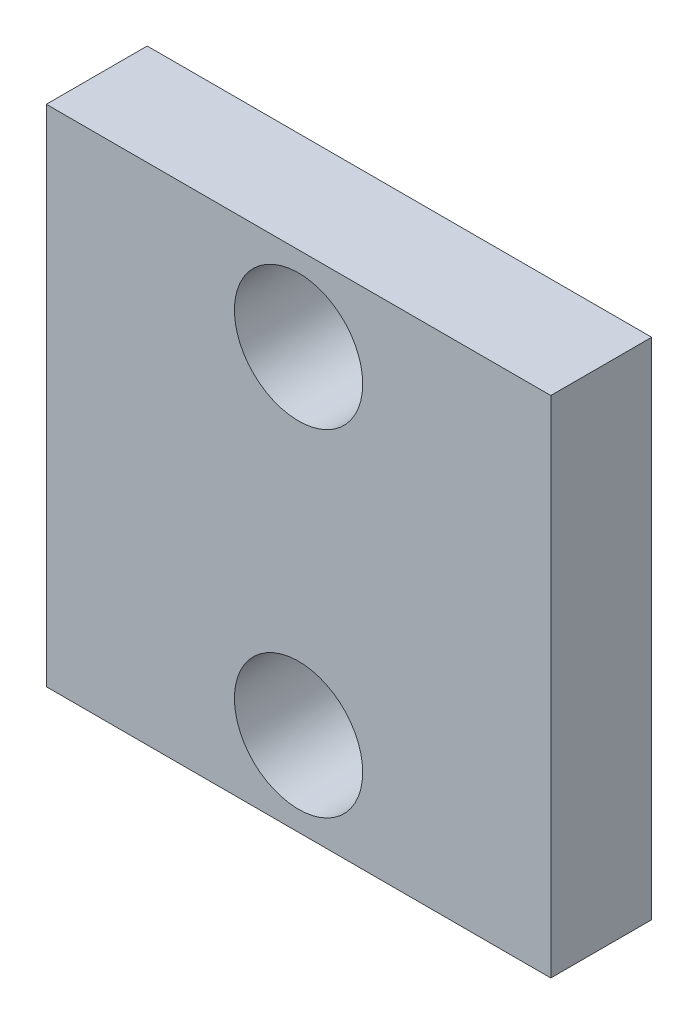
ISO-10303-21;
HEADER;
FILE_DESCRIPTION(('STEP AP214'),'2;1');
FILE_NAME('part.step','',(''),(''),'','','');
FILE_SCHEMA(('AUTOMOTIVE_DESIGN { 1 0 10303 214 1 1 1 1 }'));
ENDSEC;
DATA;
#1=APPLICATION_CONTEXT('core data for automotive mechanical design processes');
#2=APPLICATION_PROTOCOL_DEFINITION('international standard','automotive_design',2000,#1);
#3=PRODUCT_CONTEXT('',#1,'mechanical');
#4=PRODUCT('Part','Part','',(#3));
#5=PRODUCT_RELATED_PRODUCT_CATEGORY('part','',(#4));
#6=PRODUCT_DEFINITION_FORMATION('','',#4);
#7=PRODUCT_DEFINITION_CONTEXT('part definition',#1,'design');
#8=PRODUCT_DEFINITION('design','',#6,#7);
#9=PRODUCT_DEFINITION_SHAPE('','',#8);
#10=(LENGTH_UNIT() NAMED_UNIT(*) SI_UNIT(.MILLI.,.METRE.));
#11=(NAMED_UNIT(*) PLANE_ANGLE_UNIT() SI_UNIT($,.RADIAN.));
#12=(NAMED_UNIT(*) SI_UNIT($,.STERADIAN.) SOLID_ANGLE_UNIT());
#13=UNCERTAINTY_MEASURE_WITH_UNIT(LENGTH_MEASURE(1.E-05),#10,'distance_accuracy_value','');
#14=(GEOMETRIC_REPRESENTATION_CONTEXT(3) GLOBAL_UNCERTAINTY_ASSIGNED_CONTEXT((#13)) GLOBAL_UNIT_ASSIGNED_CONTEXT((#10,
#11,#12)) REPRESENTATION_CONTEXT('',''));
#15=CARTESIAN_POINT('',(0.,0.,0.));
#16=DIRECTION('',(0.,0.,1.));
#17=DIRECTION('',(1.,0.,0.));
#18=AXIS2_PLACEMENT_3D('',#15,#16,#17);
#19=CARTESIAN_POINT('',(0.,0.,12.));
#20=DIRECTION('',(0.,0.,-1.));
#21=DIRECTION('',(-1.,0.,0.));
#22=AXIS2_PLACEMENT_3D('',#19,#20,#21);
#23=PLANE('',#22);
#24=DIRECTION('',(0.,1.,0.));
#25=VECTOR('',#24,1.);
#26=CARTESIAN_POINT('',(30.,-30.,12.));
#27=LINE('',#26,#25);
#28=CARTESIAN_POINT('',(30.,-30.,12.));
#29=VERTEX_POINT('',#28);
#30=CARTESIAN_POINT('',(30.,30.,12.));
#31=VERTEX_POINT('',#30);
#32=EDGE_CURVE('E92',#29,#31,#27,.T.);
#33=ORIENTED_EDGE('',*,*,#32,.T.);
#34=DIRECTION('',(-1.,0.,0.));
#35=VECTOR('',#34,1.);
#36=CARTESIAN_POINT('',(-30.,30.,12.));
#37=LINE('',#36,#35);
#38=CARTESIAN_POINT('',(-30.,30.,12.));
#39=VERTEX_POINT('',#38);
#40=EDGE_CURVE('E87',#31,#39,#37,.T.);
#41=ORIENTED_EDGE('',*,*,#40,.T.);
#42=DIRECTION('',(0.,-1.,0.));
#43=VECTOR('',#42,1.);
#44=CARTESIAN_POINT('',(-30.,-30.,12.));
#45=LINE('',#44,#43);
#46=CARTESIAN_POINT('',(-30.,-30.,12.));
#47=VERTEX_POINT('',#46);
#48=EDGE_CURVE('E90',#39,#47,#45,.T.);
#49=ORIENTED_EDGE('',*,*,#48,.T.);
#50=DIRECTION('',(1.,0.,0.));
#51=VECTOR('',#50,1.);
#52=CARTESIAN_POINT('',(-30.,-30.,12.));
#53=LINE('',#52,#51);
#54=EDGE_CURVE('E57',#47,#29,#53,.T.);
#55=ORIENTED_EDGE('',*,*,#54,.T.);
#56=EDGE_LOOP('',(#33,#41,#49,#55));
#57=FACE_BOUND('',#56,.T.);
#58=CARTESIAN_POINT('',(0.,20.,12.));
#59=DIRECTION('',(0.,0.,1.));
#60=DIRECTION('',(1.,0.,0.));
#61=AXIS2_PLACEMENT_3D('',#58,#59,#60);
#62=CIRCLE('',#61,7.62728230322701);
#63=CARTESIAN_POINT('',(7.62728230322701,20.,12.));
#64=VERTEX_POINT('',#63);
#65=EDGE_CURVE('E112',#64,#64,#62,.T.);
#66=ORIENTED_EDGE('',*,*,#65,.F.);
#67=EDGE_LOOP('',(#66));
#68=FACE_BOUND('',#67,.T.);
#69=CARTESIAN_POINT('',(0.,-20.,12.));
#70=DIRECTION('',(0.,0.,1.));
#71=DIRECTION('',(1.,0.,0.));
#72=AXIS2_PLACEMENT_3D('',#69,#70,#71);
#73=CIRCLE('',#72,7.627282303227);
#74=CARTESIAN_POINT('',(7.627282303227,-20.,12.));
#75=VERTEX_POINT('',#74);
#76=EDGE_CURVE('E134',#75,#75,#73,.T.);
#77=ORIENTED_EDGE('',*,*,#76,.F.);
#78=EDGE_LOOP('',(#77));
#79=FACE_BOUND('',#78,.T.);
#80=ADVANCED_FACE('F39',(#57,#68,#79),#23,.F.);
#81=CARTESIAN_POINT('',(0.,0.,0.));
#82=DIRECTION('',(0.,0.,-1.));
#83=DIRECTION('',(-1.,0.,0.));
#84=AXIS2_PLACEMENT_3D('',#81,#82,#83);
#85=PLANE('',#84);
#86=CARTESIAN_POINT('',(0.,20.,0.));
#87=DIRECTION('',(0.,0.,1.));
#88=DIRECTION('',(1.,0.,0.));
#89=AXIS2_PLACEMENT_3D('',#86,#87,#88);
#90=CIRCLE('',#89,7.62728230322701);
#91=CARTESIAN_POINT('',(7.62728230322701,20.,0.));
#92=VERTEX_POINT('',#91);
#93=EDGE_CURVE('E130',#92,#92,#90,.T.);
#94=ORIENTED_EDGE('',*,*,#93,.T.);
#95=EDGE_LOOP('',(#94));
#96=FACE_BOUND('',#95,.T.);
#97=DIRECTION('',(0.,1.,0.));
#98=VECTOR('',#97,1.);
#99=CARTESIAN_POINT('',(30.,-30.,0.));
#100=LINE('',#99,#98);
#101=CARTESIAN_POINT('',(30.,-30.,0.));
#102=VERTEX_POINT('',#101);
#103=CARTESIAN_POINT('',(30.,30.,0.));
#104=VERTEX_POINT('',#103);
#105=EDGE_CURVE('E108',#102,#104,#100,.T.);
#106=ORIENTED_EDGE('',*,*,#105,.F.);
#107=DIRECTION('',(1.,0.,0.));
#108=VECTOR('',#107,1.);
#109=CARTESIAN_POINT('',(-30.,-30.,0.));
#110=LINE('',#109,#108);
#111=CARTESIAN_POINT('',(-30.,-30.,0.));
#112=VERTEX_POINT('',#111);
#113=EDGE_CURVE('E80',#112,#102,#110,.T.);
#114=ORIENTED_EDGE('',*,*,#113,.F.);
#115=DIRECTION('',(0.,-1.,0.));
#116=VECTOR('',#115,1.);
#117=CARTESIAN_POINT('',(-30.,-30.,0.));
#118=LINE('',#117,#116);
#119=CARTESIAN_POINT('',(-30.,30.,0.));
#120=VERTEX_POINT('',#119);
#121=EDGE_CURVE('E74',#120,#112,#118,.T.);
#122=ORIENTED_EDGE('',*,*,#121,.F.);
#123=DIRECTION('',(-1.,0.,0.));
#124=VECTOR('',#123,1.);
#125=CARTESIAN_POINT('',(-30.,30.,0.));
#126=LINE('',#125,#124);
#127=EDGE_CURVE('E97',#104,#120,#126,.T.);
#128=ORIENTED_EDGE('',*,*,#127,.F.);
#129=EDGE_LOOP('',(#106,#114,#122,#128));
#130=FACE_BOUND('',#129,.T.);
#131=CARTESIAN_POINT('',(0.,-20.,0.));
#132=DIRECTION('',(0.,0.,1.));
#133=DIRECTION('',(1.,0.,0.));
#134=AXIS2_PLACEMENT_3D('',#131,#132,#133);
#135=CIRCLE('',#134,7.627282303227);
#136=CARTESIAN_POINT('',(7.627282303227,-20.,0.));
#137=VERTEX_POINT('',#136);
#138=EDGE_CURVE('E138',#137,#137,#135,.T.);
#139=ORIENTED_EDGE('',*,*,#138,.T.);
#140=EDGE_LOOP('',(#139));
#141=FACE_BOUND('',#140,.T.);
#142=ADVANCED_FACE('F125',(#96,#130,#141),#85,.T.);
#143=CARTESIAN_POINT('',(30.,-30.,12.));
#144=DIRECTION('',(-1.,0.,0.));
#145=DIRECTION('',(0.,0.,1.));
#146=AXIS2_PLACEMENT_3D('',#143,#144,#145);
#147=PLANE('',#146);
#148=ORIENTED_EDGE('',*,*,#105,.T.);
#149=DIRECTION('',(0.,0.,-1.));
#150=VECTOR('',#149,1.);
#151=CARTESIAN_POINT('',(30.,30.,12.));
#152=LINE('',#151,#150);
#153=EDGE_CURVE('E11',#31,#104,#152,.T.);
#154=ORIENTED_EDGE('',*,*,#153,.F.);
#155=ORIENTED_EDGE('',*,*,#32,.F.);
#156=DIRECTION('',(0.,0.,-1.));
#157=VECTOR('',#156,1.);
#158=CARTESIAN_POINT('',(30.,-30.,12.));
#159=LINE('',#158,#157);
#160=EDGE_CURVE('E104',#29,#102,#159,.T.);
#161=ORIENTED_EDGE('',*,*,#160,.T.);
#162=EDGE_LOOP('',(#148,#154,#155,#161));
#163=FACE_BOUND('',#162,.T.);
#164=ADVANCED_FACE('F41',(#163),#147,.F.);
#165=CARTESIAN_POINT('',(-30.,30.,12.));
#166=DIRECTION('',(0.,-1.,0.));
#167=DIRECTION('',(0.,0.,-1.));
#168=AXIS2_PLACEMENT_3D('',#165,#166,#167);
#169=PLANE('',#168);
#170=ORIENTED_EDGE('',*,*,#127,.T.);
#171=DIRECTION('',(0.,0.,-1.));
#172=VECTOR('',#171,1.);
#173=CARTESIAN_POINT('',(-30.,30.,12.));
#174=LINE('',#173,#172);
#175=EDGE_CURVE('E49',#39,#120,#174,.T.);
#176=ORIENTED_EDGE('',*,*,#175,.F.);
#177=ORIENTED_EDGE('',*,*,#40,.F.);
#178=ORIENTED_EDGE('',*,*,#153,.T.);
#179=EDGE_LOOP('',(#170,#176,#177,#178));
#180=FACE_BOUND('',#179,.T.);
#181=ADVANCED_FACE('F96',(#180),#169,.F.);
#182=CARTESIAN_POINT('',(-30.,-30.,12.));
#183=DIRECTION('',(1.,0.,0.));
#184=DIRECTION('',(0.,0.,-1.));
#185=AXIS2_PLACEMENT_3D('',#182,#183,#184);
#186=PLANE('',#185);
#187=ORIENTED_EDGE('',*,*,#121,.T.);
#188=DIRECTION('',(0.,0.,-1.));
#189=VECTOR('',#188,1.);
#190=CARTESIAN_POINT('',(-30.,-30.,12.));
#191=LINE('',#190,#189);
#192=EDGE_CURVE('E99',#47,#112,#191,.T.);
#193=ORIENTED_EDGE('',*,*,#192,.F.);
#194=ORIENTED_EDGE('',*,*,#48,.F.);
#195=ORIENTED_EDGE('',*,*,#175,.T.);
#196=EDGE_LOOP('',(#187,#193,#194,#195));
#197=FACE_BOUND('',#196,.T.);
#198=ADVANCED_FACE('F100',(#197),#186,.F.);
#199=CARTESIAN_POINT('',(-30.,-30.,12.));
#200=DIRECTION('',(0.,1.,0.));
#201=DIRECTION('',(0.,0.,1.));
#202=AXIS2_PLACEMENT_3D('',#199,#200,#201);
#203=PLANE('',#202);
#204=ORIENTED_EDGE('',*,*,#113,.T.);
#205=ORIENTED_EDGE('',*,*,#160,.F.);
#206=ORIENTED_EDGE('',*,*,#54,.F.);
#207=ORIENTED_EDGE('',*,*,#192,.T.);
#208=EDGE_LOOP('',(#204,#205,#206,#207));
#209=FACE_BOUND('',#208,.T.);
#210=ADVANCED_FACE('F122',(#209),#203,.F.);
#211=CARTESIAN_POINT('',(0.,20.,12.));
#212=DIRECTION('',(0.,0.,-1.));
#213=DIRECTION('',(-1.,0.,0.));
#214=AXIS2_PLACEMENT_3D('',#211,#212,#213);
#215=CYLINDRICAL_SURFACE('',#214,7.62728230322701);
#216=ORIENTED_EDGE('',*,*,#65,.T.);
#217=EDGE_LOOP('',(#216));
#218=FACE_BOUND('',#217,.T.);
#219=ORIENTED_EDGE('',*,*,#93,.F.);
#220=EDGE_LOOP('',(#219));
#221=FACE_BOUND('',#220,.T.);
#222=ADVANCED_FACE('F157',(#218,#221),#215,.F.);
#223=CARTESIAN_POINT('',(0.,-20.,12.));
#224=DIRECTION('',(0.,0.,-1.));
#225=DIRECTION('',(-1.,0.,0.));
#226=AXIS2_PLACEMENT_3D('',#223,#224,#225);
#227=CYLINDRICAL_SURFACE('',#226,7.627282303227);
#228=ORIENTED_EDGE('',*,*,#76,.T.);
#229=EDGE_LOOP('',(#228));
#230=FACE_BOUND('',#229,.T.);
#231=ORIENTED_EDGE('',*,*,#138,.F.);
#232=EDGE_LOOP('',(#231));
#233=FACE_BOUND('',#232,.T.);
#234=ADVANCED_FACE('F146',(#230,#233),#227,.F.);
#235=CLOSED_SHELL('',(#80,#142,#164,#181,#198,#210,#222,#234));
#236=MANIFOLD_SOLID_BREP('B2',#235);
#237=ADVANCED_BREP_SHAPE_REPRESENTATION('',(#18,#236),#14);
#238=SHAPE_DEFINITION_REPRESENTATION(#9,#237);
ENDSEC;
END-ISO-10303-21;
